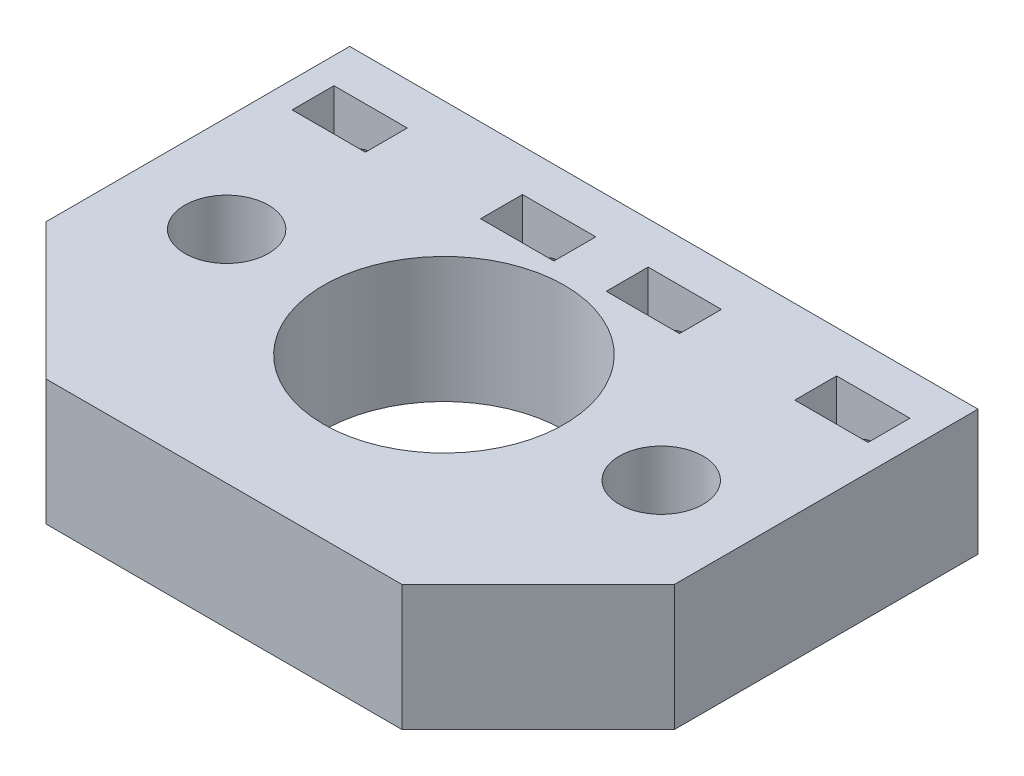
ISO-10303-21;
HEADER;
FILE_DESCRIPTION(('STEP AP214'),'2;1');
FILE_NAME('part.step','',(''),(''),'','','');
FILE_SCHEMA(('AUTOMOTIVE_DESIGN { 1 0 10303 214 1 1 1 1 }'));
ENDSEC;
DATA;
#1=APPLICATION_CONTEXT('core data for automotive mechanical design processes');
#2=APPLICATION_PROTOCOL_DEFINITION('international standard','automotive_design',2000,#1);
#3=PRODUCT_CONTEXT('',#1,'mechanical');
#4=PRODUCT('Part','Part','',(#3));
#5=PRODUCT_RELATED_PRODUCT_CATEGORY('part','',(#4));
#6=PRODUCT_DEFINITION_FORMATION('','',#4);
#7=PRODUCT_DEFINITION_CONTEXT('part definition',#1,'design');
#8=PRODUCT_DEFINITION('design','',#6,#7);
#9=PRODUCT_DEFINITION_SHAPE('','',#8);
#10=(LENGTH_UNIT() NAMED_UNIT(*) SI_UNIT(.MILLI.,.METRE.));
#11=(NAMED_UNIT(*) PLANE_ANGLE_UNIT() SI_UNIT($,.RADIAN.));
#12=(NAMED_UNIT(*) SI_UNIT($,.STERADIAN.) SOLID_ANGLE_UNIT());
#13=UNCERTAINTY_MEASURE_WITH_UNIT(LENGTH_MEASURE(1.E-05),#10,'distance_accuracy_value','');
#14=(GEOMETRIC_REPRESENTATION_CONTEXT(3) GLOBAL_UNCERTAINTY_ASSIGNED_CONTEXT((#13)) GLOBAL_UNIT_ASSIGNED_CONTEXT((#10,
#11,#12)) REPRESENTATION_CONTEXT('',''));
#15=CARTESIAN_POINT('',(0.,0.,0.));
#16=DIRECTION('',(0.,0.,1.));
#17=DIRECTION('',(1.,0.,0.));
#18=AXIS2_PLACEMENT_3D('',#15,#16,#17);
#19=CARTESIAN_POINT('',(0.,12.,0.));
#20=DIRECTION('',(0.,-1.,0.));
#21=DIRECTION('',(0.,0.,-1.));
#22=AXIS2_PLACEMENT_3D('',#19,#20,#21);
#23=PLANE('',#22);
#24=DIRECTION('',(1.,0.,0.));
#25=VECTOR('',#24,1.);
#26=CARTESIAN_POINT('',(0.,12.,-12.9999999999999));
#27=LINE('',#26,#25);
#28=CARTESIAN_POINT('',(2.49999999999995,12.,-12.9999999999999));
#29=VERTEX_POINT('',#28);
#30=CARTESIAN_POINT('',(9.49999999999995,12.,-12.9999999999999));
#31=VERTEX_POINT('',#30);
#32=EDGE_CURVE('E304',#29,#31,#27,.T.);
#33=ORIENTED_EDGE('',*,*,#32,.F.);
#34=DIRECTION('',(0.,0.,1.));
#35=VECTOR('',#34,1.);
#36=CARTESIAN_POINT('',(2.49999999999996,12.,0.));
#37=LINE('',#36,#35);
#38=CARTESIAN_POINT('',(2.49999999999994,12.,-17.));
#39=VERTEX_POINT('',#38);
#40=EDGE_CURVE('E298',#39,#29,#37,.T.);
#41=ORIENTED_EDGE('',*,*,#40,.F.);
#42=DIRECTION('',(-1.,0.,0.));
#43=VECTOR('',#42,1.);
#44=CARTESIAN_POINT('',(2.94902990916058E-13,12.,-17.));
#45=LINE('',#44,#43);
#46=CARTESIAN_POINT('',(9.49999999999994,12.,-16.9999999999999));
#47=VERTEX_POINT('',#46);
#48=EDGE_CURVE('E300',#47,#39,#45,.T.);
#49=ORIENTED_EDGE('',*,*,#48,.F.);
#50=DIRECTION('',(0.,0.,-1.));
#51=VECTOR('',#50,1.);
#52=CARTESIAN_POINT('',(9.49999999999997,12.,0.));
#53=LINE('',#52,#51);
#54=EDGE_CURVE('E302',#31,#47,#53,.T.);
#55=ORIENTED_EDGE('',*,*,#54,.F.);
#56=EDGE_LOOP('',(#33,#41,#49,#55));
#57=FACE_BOUND('',#56,.T.);
#58=DIRECTION('',(0.,0.,1.));
#59=VECTOR('',#58,1.);
#60=CARTESIAN_POINT('',(-27.5,12.,0.));
#61=LINE('',#60,#59);
#62=CARTESIAN_POINT('',(-27.4999999999999,12.,-17.));
#63=VERTEX_POINT('',#62);
#64=CARTESIAN_POINT('',(-27.4999999999999,12.,-13.));
#65=VERTEX_POINT('',#64);
#66=EDGE_CURVE('E287',#63,#65,#61,.T.);
#67=ORIENTED_EDGE('',*,*,#66,.F.);
#68=DIRECTION('',(-1.,0.,0.));
#69=VECTOR('',#68,1.);
#70=CARTESIAN_POINT('',(-3.03328790656524E-13,12.,-17.0000000000005));
#71=LINE('',#70,#69);
#72=CARTESIAN_POINT('',(-20.4999999999999,12.,-17.0000000000001));
#73=VERTEX_POINT('',#72);
#74=EDGE_CURVE('E196',#73,#63,#71,.T.);
#75=ORIENTED_EDGE('',*,*,#74,.F.);
#76=DIRECTION('',(0.,0.,-1.));
#77=VECTOR('',#76,1.);
#78=CARTESIAN_POINT('',(-20.5,12.,0.));
#79=LINE('',#78,#77);
#80=CARTESIAN_POINT('',(-20.4999999999999,12.,-13.));
#81=VERTEX_POINT('',#80);
#82=EDGE_CURVE('E282',#81,#73,#79,.T.);
#83=ORIENTED_EDGE('',*,*,#82,.F.);
#84=DIRECTION('',(1.,0.,0.));
#85=VECTOR('',#84,1.);
#86=CARTESIAN_POINT('',(0.,12.,-13.));
#87=LINE('',#86,#85);
#88=EDGE_CURVE('E285',#65,#81,#87,.T.);
#89=ORIENTED_EDGE('',*,*,#88,.F.);
#90=EDGE_LOOP('',(#67,#75,#83,#89));
#91=FACE_BOUND('',#90,.T.);
#92=CARTESIAN_POINT('',(-20.75,12.,0.));
#93=DIRECTION('',(0.,-1.,0.));
#94=DIRECTION('',(0.,0.,-1.));
#95=AXIS2_PLACEMENT_3D('',#92,#93,#94);
#96=CIRCLE('',#95,4.);
#97=CARTESIAN_POINT('',(-20.75,12.,-4.00000000000001));
#98=VERTEX_POINT('',#97);
#99=EDGE_CURVE('E328',#98,#98,#96,.F.);
#100=ORIENTED_EDGE('',*,*,#99,.F.);
#101=EDGE_LOOP('',(#100));
#102=FACE_BOUND('',#101,.T.);
#103=CARTESIAN_POINT('',(20.75,12.,0.));
#104=DIRECTION('',(0.,-1.,0.));
#105=DIRECTION('',(0.,0.,-1.));
#106=AXIS2_PLACEMENT_3D('',#103,#104,#105);
#107=CIRCLE('',#106,4.);
#108=CARTESIAN_POINT('',(20.75,12.,-4.));
#109=VERTEX_POINT('',#108);
#110=EDGE_CURVE('E325',#109,#109,#107,.F.);
#111=ORIENTED_EDGE('',*,*,#110,.F.);
#112=EDGE_LOOP('',(#111));
#113=FACE_BOUND('',#112,.T.);
#114=CARTESIAN_POINT('',(0.,12.,0.));
#115=DIRECTION('',(0.,-1.,0.));
#116=DIRECTION('',(0.,0.,-1.));
#117=AXIS2_PLACEMENT_3D('',#114,#115,#116);
#118=CIRCLE('',#117,11.5);
#119=CARTESIAN_POINT('',(0.,12.,-11.5));
#120=VERTEX_POINT('',#119);
#121=EDGE_CURVE('E322',#120,#120,#118,.F.);
#122=ORIENTED_EDGE('',*,*,#121,.F.);
#123=EDGE_LOOP('',(#122));
#124=FACE_BOUND('',#123,.T.);
#125=DIRECTION('',(1.,0.,0.));
#126=VECTOR('',#125,1.);
#127=CARTESIAN_POINT('',(-30.,12.,21.));
#128=LINE('',#127,#126);
#129=CARTESIAN_POINT('',(-17.,12.,21.));
#130=VERTEX_POINT('',#129);
#131=CARTESIAN_POINT('',(17.,12.,21.));
#132=VERTEX_POINT('',#131);
#133=EDGE_CURVE('E340',#130,#132,#128,.T.);
#134=ORIENTED_EDGE('',*,*,#133,.T.);
#135=DIRECTION('',(-0.707106781186549,0.,0.707106781186546));
#136=VECTOR('',#135,1.);
#137=CARTESIAN_POINT('',(30.,12.,8.00000000000002));
#138=LINE('',#137,#136);
#139=CARTESIAN_POINT('',(30.,12.,8.00000000000002));
#140=VERTEX_POINT('',#139);
#141=EDGE_CURVE('E45',#132,#140,#138,.F.);
#142=ORIENTED_EDGE('',*,*,#141,.T.);
#143=DIRECTION('',(0.,0.,-1.));
#144=VECTOR('',#143,1.);
#145=CARTESIAN_POINT('',(30.,12.,21.));
#146=LINE('',#145,#144);
#147=CARTESIAN_POINT('',(30.,12.,-21.));
#148=VERTEX_POINT('',#147);
#149=EDGE_CURVE('E332',#140,#148,#146,.T.);
#150=ORIENTED_EDGE('',*,*,#149,.T.);
#151=DIRECTION('',(-1.,0.,0.));
#152=VECTOR('',#151,1.);
#153=CARTESIAN_POINT('',(-30.,12.,-21.));
#154=LINE('',#153,#152);
#155=CARTESIAN_POINT('',(-30.,12.,-21.));
#156=VERTEX_POINT('',#155);
#157=EDGE_CURVE('E334',#148,#156,#154,.T.);
#158=ORIENTED_EDGE('',*,*,#157,.T.);
#159=DIRECTION('',(0.,0.,1.));
#160=VECTOR('',#159,1.);
#161=CARTESIAN_POINT('',(-30.,12.,21.));
#162=LINE('',#161,#160);
#163=CARTESIAN_POINT('',(-30.,12.,7.99999999999996));
#164=VERTEX_POINT('',#163);
#165=EDGE_CURVE('E337',#156,#164,#162,.T.);
#166=ORIENTED_EDGE('',*,*,#165,.T.);
#167=DIRECTION('',(-0.707106781186546,0.,-0.707106781186549));
#168=VECTOR('',#167,1.);
#169=CARTESIAN_POINT('',(-17.,12.,21.));
#170=LINE('',#169,#168);
#171=EDGE_CURVE('E369',#164,#130,#170,.F.);
#172=ORIENTED_EDGE('',*,*,#171,.T.);
#173=EDGE_LOOP('',(#134,#142,#150,#158,#166,#172));
#174=FACE_BOUND('',#173,.T.);
#175=DIRECTION('',(0.,0.,1.));
#176=VECTOR('',#175,1.);
#177=CARTESIAN_POINT('',(-9.49999999999995,12.,0.));
#178=LINE('',#177,#176);
#179=CARTESIAN_POINT('',(-9.49999999999994,12.,-16.9999999999999));
#180=VERTEX_POINT('',#179);
#181=CARTESIAN_POINT('',(-9.49999999999994,12.,-12.9999999999999));
#182=VERTEX_POINT('',#181);
#183=EDGE_CURVE('E296',#180,#182,#178,.T.);
#184=ORIENTED_EDGE('',*,*,#183,.F.);
#185=DIRECTION('',(-1.,0.,0.));
#186=VECTOR('',#185,1.);
#187=CARTESIAN_POINT('',(-3.03328790656517E-13,12.,-17.));
#188=LINE('',#187,#186);
#189=CARTESIAN_POINT('',(-2.49999999999994,12.,-17.));
#190=VERTEX_POINT('',#189);
#191=EDGE_CURVE('E289',#190,#180,#188,.T.);
#192=ORIENTED_EDGE('',*,*,#191,.F.);
#193=DIRECTION('',(0.,0.,-1.));
#194=VECTOR('',#193,1.);
#195=CARTESIAN_POINT('',(-2.49999999999995,12.,0.));
#196=LINE('',#195,#194);
#197=CARTESIAN_POINT('',(-2.49999999999994,12.,-12.9999999999999));
#198=VERTEX_POINT('',#197);
#199=EDGE_CURVE('E291',#198,#190,#196,.T.);
#200=ORIENTED_EDGE('',*,*,#199,.F.);
#201=DIRECTION('',(1.,0.,0.));
#202=VECTOR('',#201,1.);
#203=CARTESIAN_POINT('',(0.,12.,-12.9999999999999));
#204=LINE('',#203,#202);
#205=EDGE_CURVE('E294',#182,#198,#204,.T.);
#206=ORIENTED_EDGE('',*,*,#205,.F.);
#207=EDGE_LOOP('',(#184,#192,#200,#206));
#208=FACE_BOUND('',#207,.T.);
#209=DIRECTION('',(0.,0.,1.));
#210=VECTOR('',#209,1.);
#211=CARTESIAN_POINT('',(20.5,12.,0.));
#212=LINE('',#211,#210);
#213=CARTESIAN_POINT('',(20.4999999999999,12.,-17.0000000000001));
#214=VERTEX_POINT('',#213);
#215=CARTESIAN_POINT('',(20.4999999999999,12.,-13.));
#216=VERTEX_POINT('',#215);
#217=EDGE_CURVE('E193',#214,#216,#212,.T.);
#218=ORIENTED_EDGE('',*,*,#217,.F.);
#219=DIRECTION('',(-1.,0.,0.));
#220=VECTOR('',#219,1.);
#221=CARTESIAN_POINT('',(2.94902990916065E-13,12.,-17.0000000000005));
#222=LINE('',#221,#220);
#223=CARTESIAN_POINT('',(27.4999999999999,12.,-17.));
#224=VERTEX_POINT('',#223);
#225=EDGE_CURVE('E306',#224,#214,#222,.T.);
#226=ORIENTED_EDGE('',*,*,#225,.F.);
#227=DIRECTION('',(0.,0.,-1.));
#228=VECTOR('',#227,1.);
#229=CARTESIAN_POINT('',(27.5,12.,0.));
#230=LINE('',#229,#228);
#231=CARTESIAN_POINT('',(27.4999999999999,12.,-13.));
#232=VERTEX_POINT('',#231);
#233=EDGE_CURVE('E308',#232,#224,#230,.T.);
#234=ORIENTED_EDGE('',*,*,#233,.F.);
#235=DIRECTION('',(1.,0.,0.));
#236=VECTOR('',#235,1.);
#237=CARTESIAN_POINT('',(0.,12.,-13.));
#238=LINE('',#237,#236);
#239=EDGE_CURVE('E310',#216,#232,#238,.T.);
#240=ORIENTED_EDGE('',*,*,#239,.F.);
#241=EDGE_LOOP('',(#218,#226,#234,#240));
#242=FACE_BOUND('',#241,.T.);
#243=ADVANCED_FACE('F35',(#57,#91,#102,#113,#124,#174,#208,#242),#23,.F.);
#244=CARTESIAN_POINT('',(0.,0.,0.));
#245=DIRECTION('',(0.,-1.,0.));
#246=DIRECTION('',(0.,0.,-1.));
#247=AXIS2_PLACEMENT_3D('',#244,#245,#246);
#248=PLANE('',#247);
#249=CARTESIAN_POINT('',(-20.75,0.,0.));
#250=DIRECTION('',(0.,-1.,0.));
#251=DIRECTION('',(0.,0.,-1.));
#252=AXIS2_PLACEMENT_3D('',#249,#250,#251);
#253=CIRCLE('',#252,4.);
#254=CARTESIAN_POINT('',(-20.75,0.,-4.00000000000001));
#255=VERTEX_POINT('',#254);
#256=EDGE_CURVE('E313',#255,#255,#253,.F.);
#257=ORIENTED_EDGE('',*,*,#256,.T.);
#258=EDGE_LOOP('',(#257));
#259=FACE_BOUND('',#258,.T.);
#260=CARTESIAN_POINT('',(20.75,0.,0.));
#261=DIRECTION('',(0.,-1.,0.));
#262=DIRECTION('',(0.,0.,-1.));
#263=AXIS2_PLACEMENT_3D('',#260,#261,#262);
#264=CIRCLE('',#263,4.);
#265=CARTESIAN_POINT('',(20.75,0.,-4.));
#266=VERTEX_POINT('',#265);
#267=EDGE_CURVE('E314',#266,#266,#264,.F.);
#268=ORIENTED_EDGE('',*,*,#267,.T.);
#269=EDGE_LOOP('',(#268));
#270=FACE_BOUND('',#269,.T.);
#271=CARTESIAN_POINT('',(0.,0.,0.));
#272=DIRECTION('',(0.,-1.,0.));
#273=DIRECTION('',(0.,0.,-1.));
#274=AXIS2_PLACEMENT_3D('',#271,#272,#273);
#275=CIRCLE('',#274,11.5);
#276=CARTESIAN_POINT('',(0.,0.,-11.5));
#277=VERTEX_POINT('',#276);
#278=EDGE_CURVE('E317',#277,#277,#275,.F.);
#279=ORIENTED_EDGE('',*,*,#278,.T.);
#280=EDGE_LOOP('',(#279));
#281=FACE_BOUND('',#280,.T.);
#282=DIRECTION('',(0.,0.,-1.));
#283=VECTOR('',#282,1.);
#284=CARTESIAN_POINT('',(30.,0.,21.));
#285=LINE('',#284,#283);
#286=CARTESIAN_POINT('',(30.,0.,8.00000000000002));
#287=VERTEX_POINT('',#286);
#288=CARTESIAN_POINT('',(30.,0.,-21.));
#289=VERTEX_POINT('',#288);
#290=EDGE_CURVE('E331',#287,#289,#285,.T.);
#291=ORIENTED_EDGE('',*,*,#290,.F.);
#292=DIRECTION('',(0.707106781186549,0.,-0.707106781186546));
#293=VECTOR('',#292,1.);
#294=CARTESIAN_POINT('',(18.9999999999999,0.,19.));
#295=LINE('',#294,#293);
#296=CARTESIAN_POINT('',(17.,0.,21.));
#297=VERTEX_POINT('',#296);
#298=EDGE_CURVE('E362',#287,#297,#295,.F.);
#299=ORIENTED_EDGE('',*,*,#298,.T.);
#300=DIRECTION('',(1.,0.,0.));
#301=VECTOR('',#300,1.);
#302=CARTESIAN_POINT('',(-30.,0.,21.));
#303=LINE('',#302,#301);
#304=CARTESIAN_POINT('',(-17.,0.,21.));
#305=VERTEX_POINT('',#304);
#306=EDGE_CURVE('E335',#305,#297,#303,.T.);
#307=ORIENTED_EDGE('',*,*,#306,.F.);
#308=DIRECTION('',(0.707106781186546,0.,0.707106781186549));
#309=VECTOR('',#308,1.);
#310=CARTESIAN_POINT('',(-19.,0.,19.));
#311=LINE('',#310,#309);
#312=CARTESIAN_POINT('',(-30.,0.,7.99999999999996));
#313=VERTEX_POINT('',#312);
#314=EDGE_CURVE('E360',#305,#313,#311,.F.);
#315=ORIENTED_EDGE('',*,*,#314,.T.);
#316=DIRECTION('',(0.,0.,1.));
#317=VECTOR('',#316,1.);
#318=CARTESIAN_POINT('',(-30.,0.,21.));
#319=LINE('',#318,#317);
#320=CARTESIAN_POINT('',(-30.,0.,-21.));
#321=VERTEX_POINT('',#320);
#322=EDGE_CURVE('E347',#321,#313,#319,.T.);
#323=ORIENTED_EDGE('',*,*,#322,.F.);
#324=DIRECTION('',(-1.,0.,0.));
#325=VECTOR('',#324,1.);
#326=CARTESIAN_POINT('',(-30.,0.,-21.));
#327=LINE('',#326,#325);
#328=EDGE_CURVE('E345',#289,#321,#327,.T.);
#329=ORIENTED_EDGE('',*,*,#328,.F.);
#330=EDGE_LOOP('',(#291,#299,#307,#315,#323,#329));
#331=FACE_BOUND('',#330,.T.);
#332=DIRECTION('',(-1.,0.,0.));
#333=VECTOR('',#332,1.);
#334=CARTESIAN_POINT('',(-27.4999999999999,0.,-17.));
#335=LINE('',#334,#333);
#336=CARTESIAN_POINT('',(-20.4999999999999,0.,-17.0000000000001));
#337=VERTEX_POINT('',#336);
#338=CARTESIAN_POINT('',(-27.4999999999999,0.,-17.));
#339=VERTEX_POINT('',#338);
#340=EDGE_CURVE('E264',#337,#339,#335,.T.);
#341=ORIENTED_EDGE('',*,*,#340,.T.);
#342=DIRECTION('',(0.,0.,1.));
#343=VECTOR('',#342,1.);
#344=CARTESIAN_POINT('',(-27.4999999999999,0.,-17.));
#345=LINE('',#344,#343);
#346=CARTESIAN_POINT('',(-27.4999999999999,0.,-13.));
#347=VERTEX_POINT('',#346);
#348=EDGE_CURVE('E267',#339,#347,#345,.T.);
#349=ORIENTED_EDGE('',*,*,#348,.T.);
#350=DIRECTION('',(1.,0.,0.));
#351=VECTOR('',#350,1.);
#352=CARTESIAN_POINT('',(-27.4999999999999,0.,-13.));
#353=LINE('',#352,#351);
#354=CARTESIAN_POINT('',(-20.4999999999999,0.,-13.));
#355=VERTEX_POINT('',#354);
#356=EDGE_CURVE('E270',#347,#355,#353,.T.);
#357=ORIENTED_EDGE('',*,*,#356,.T.);
#358=DIRECTION('',(0.,0.,-1.));
#359=VECTOR('',#358,1.);
#360=CARTESIAN_POINT('',(-20.4999999999999,0.,-17.0000000000001));
#361=LINE('',#360,#359);
#362=EDGE_CURVE('E261',#355,#337,#361,.T.);
#363=ORIENTED_EDGE('',*,*,#362,.T.);
#364=EDGE_LOOP('',(#341,#349,#357,#363));
#365=FACE_BOUND('',#364,.T.);
#366=DIRECTION('',(-1.,0.,0.));
#367=VECTOR('',#366,1.);
#368=CARTESIAN_POINT('',(-9.49999999999994,0.,-16.9999999999999));
#369=LINE('',#368,#367);
#370=CARTESIAN_POINT('',(-2.49999999999994,0.,-17.));
#371=VERTEX_POINT('',#370);
#372=CARTESIAN_POINT('',(-9.49999999999994,0.,-16.9999999999999));
#373=VERTEX_POINT('',#372);
#374=EDGE_CURVE('E243',#371,#373,#369,.T.);
#375=ORIENTED_EDGE('',*,*,#374,.T.);
#376=DIRECTION('',(0.,0.,1.));
#377=VECTOR('',#376,1.);
#378=CARTESIAN_POINT('',(-9.49999999999994,0.,-16.9999999999999));
#379=LINE('',#378,#377);
#380=CARTESIAN_POINT('',(-9.49999999999994,0.,-12.9999999999999));
#381=VERTEX_POINT('',#380);
#382=EDGE_CURVE('E247',#373,#381,#379,.T.);
#383=ORIENTED_EDGE('',*,*,#382,.T.);
#384=DIRECTION('',(1.,0.,0.));
#385=VECTOR('',#384,1.);
#386=CARTESIAN_POINT('',(-9.49999999999994,0.,-12.9999999999999));
#387=LINE('',#386,#385);
#388=CARTESIAN_POINT('',(-2.49999999999994,0.,-12.9999999999999));
#389=VERTEX_POINT('',#388);
#390=EDGE_CURVE('E250',#381,#389,#387,.T.);
#391=ORIENTED_EDGE('',*,*,#390,.T.);
#392=DIRECTION('',(0.,0.,-1.));
#393=VECTOR('',#392,1.);
#394=CARTESIAN_POINT('',(-2.49999999999994,0.,-17.));
#395=LINE('',#394,#393);
#396=EDGE_CURVE('E240',#389,#371,#395,.T.);
#397=ORIENTED_EDGE('',*,*,#396,.T.);
#398=EDGE_LOOP('',(#375,#383,#391,#397));
#399=FACE_BOUND('',#398,.T.);
#400=DIRECTION('',(0.,0.,1.));
#401=VECTOR('',#400,1.);
#402=CARTESIAN_POINT('',(2.49999999999994,0.,-17.));
#403=LINE('',#402,#401);
#404=CARTESIAN_POINT('',(2.49999999999994,0.,-17.));
#405=VERTEX_POINT('',#404);
#406=CARTESIAN_POINT('',(2.49999999999995,0.,-12.9999999999999));
#407=VERTEX_POINT('',#406);
#408=EDGE_CURVE('E222',#405,#407,#403,.T.);
#409=ORIENTED_EDGE('',*,*,#408,.T.);
#410=DIRECTION('',(1.,0.,0.));
#411=VECTOR('',#410,1.);
#412=CARTESIAN_POINT('',(9.49999999999995,0.,-12.9999999999999));
#413=LINE('',#412,#411);
#414=CARTESIAN_POINT('',(9.49999999999995,0.,-12.9999999999999));
#415=VERTEX_POINT('',#414);
#416=EDGE_CURVE('E226',#407,#415,#413,.T.);
#417=ORIENTED_EDGE('',*,*,#416,.T.);
#418=DIRECTION('',(0.,0.,-1.));
#419=VECTOR('',#418,1.);
#420=CARTESIAN_POINT('',(9.49999999999994,0.,-16.9999999999999));
#421=LINE('',#420,#419);
#422=CARTESIAN_POINT('',(9.49999999999994,0.,-16.9999999999999));
#423=VERTEX_POINT('',#422);
#424=EDGE_CURVE('E229',#415,#423,#421,.T.);
#425=ORIENTED_EDGE('',*,*,#424,.T.);
#426=DIRECTION('',(-1.,0.,0.));
#427=VECTOR('',#426,1.);
#428=CARTESIAN_POINT('',(9.49999999999994,0.,-16.9999999999999));
#429=LINE('',#428,#427);
#430=EDGE_CURVE('E219',#423,#405,#429,.T.);
#431=ORIENTED_EDGE('',*,*,#430,.T.);
#432=EDGE_LOOP('',(#409,#417,#425,#431));
#433=FACE_BOUND('',#432,.T.);
#434=DIRECTION('',(-1.,0.,0.));
#435=VECTOR('',#434,1.);
#436=CARTESIAN_POINT('',(27.4999999999999,0.,-17.));
#437=LINE('',#436,#435);
#438=CARTESIAN_POINT('',(27.4999999999999,0.,-17.));
#439=VERTEX_POINT('',#438);
#440=CARTESIAN_POINT('',(20.4999999999999,0.,-17.0000000000001));
#441=VERTEX_POINT('',#440);
#442=EDGE_CURVE('E210',#439,#441,#437,.T.);
#443=ORIENTED_EDGE('',*,*,#442,.T.);
#444=DIRECTION('',(0.,0.,1.));
#445=VECTOR('',#444,1.);
#446=CARTESIAN_POINT('',(20.4999999999999,0.,-17.0000000000001));
#447=LINE('',#446,#445);
#448=CARTESIAN_POINT('',(20.4999999999999,0.,-13.));
#449=VERTEX_POINT('',#448);
#450=EDGE_CURVE('E190',#441,#449,#447,.T.);
#451=ORIENTED_EDGE('',*,*,#450,.T.);
#452=DIRECTION('',(1.,0.,0.));
#453=VECTOR('',#452,1.);
#454=CARTESIAN_POINT('',(27.4999999999999,0.,-13.));
#455=LINE('',#454,#453);
#456=CARTESIAN_POINT('',(27.4999999999999,0.,-13.));
#457=VERTEX_POINT('',#456);
#458=EDGE_CURVE('E200',#449,#457,#455,.T.);
#459=ORIENTED_EDGE('',*,*,#458,.T.);
#460=DIRECTION('',(0.,0.,-1.));
#461=VECTOR('',#460,1.);
#462=CARTESIAN_POINT('',(27.4999999999999,0.,-17.));
#463=LINE('',#462,#461);
#464=EDGE_CURVE('E212',#457,#439,#463,.T.);
#465=ORIENTED_EDGE('',*,*,#464,.T.);
#466=EDGE_LOOP('',(#443,#451,#459,#465));
#467=FACE_BOUND('',#466,.T.);
#468=ADVANCED_FACE('F209',(#259,#270,#281,#331,#365,#399,#433,#467),#248,.T.);
#469=CARTESIAN_POINT('',(30.,12.,21.));
#470=DIRECTION('',(-1.,0.,0.));
#471=DIRECTION('',(0.,0.,1.));
#472=AXIS2_PLACEMENT_3D('',#469,#470,#471);
#473=PLANE('',#472);
#474=ORIENTED_EDGE('',*,*,#149,.F.);
#475=DIRECTION('',(0.,-1.,0.));
#476=VECTOR('',#475,1.);
#477=CARTESIAN_POINT('',(30.,12.,8.00000000000002));
#478=LINE('',#477,#476);
#479=EDGE_CURVE('E357',#140,#287,#478,.T.);
#480=ORIENTED_EDGE('',*,*,#479,.T.);
#481=ORIENTED_EDGE('',*,*,#290,.T.);
#482=DIRECTION('',(0.,-1.,0.));
#483=VECTOR('',#482,1.);
#484=CARTESIAN_POINT('',(30.,12.,-21.));
#485=LINE('',#484,#483);
#486=EDGE_CURVE('E354',#148,#289,#485,.T.);
#487=ORIENTED_EDGE('',*,*,#486,.F.);
#488=EDGE_LOOP('',(#474,#480,#481,#487));
#489=FACE_BOUND('',#488,.T.);
#490=ADVANCED_FACE('F414',(#489),#473,.F.);
#491=CARTESIAN_POINT('',(-30.,12.,-21.));
#492=DIRECTION('',(0.,0.,1.));
#493=DIRECTION('',(1.,0.,0.));
#494=AXIS2_PLACEMENT_3D('',#491,#492,#493);
#495=PLANE('',#494);
#496=CARTESIAN_POINT('',(24.,6.,-21.));
#497=DIRECTION('',(0.,0.,-1.));
#498=DIRECTION('',(-1.,0.,0.));
#499=AXIS2_PLACEMENT_3D('',#496,#497,#498);
#500=CIRCLE('',#499,2.25);
#501=CARTESIAN_POINT('',(21.75,6.,-21.));
#502=VERTEX_POINT('',#501);
#503=EDGE_CURVE('E376',#502,#502,#500,.T.);
#504=ORIENTED_EDGE('',*,*,#503,.F.);
#505=EDGE_LOOP('',(#504));
#506=FACE_BOUND('',#505,.T.);
#507=CARTESIAN_POINT('',(-6.,6.,-21.));
#508=DIRECTION('',(0.,0.,-1.));
#509=DIRECTION('',(1.,0.,0.));
#510=AXIS2_PLACEMENT_3D('',#507,#508,#509);
#511=CIRCLE('',#510,2.25);
#512=CARTESIAN_POINT('',(-3.75,6.,-21.));
#513=VERTEX_POINT('',#512);
#514=EDGE_CURVE('E517',#513,#513,#511,.T.);
#515=ORIENTED_EDGE('',*,*,#514,.F.);
#516=EDGE_LOOP('',(#515));
#517=FACE_BOUND('',#516,.T.);
#518=CARTESIAN_POINT('',(6.,6.,-21.));
#519=DIRECTION('',(0.,0.,-1.));
#520=DIRECTION('',(-1.,0.,0.));
#521=AXIS2_PLACEMENT_3D('',#518,#519,#520);
#522=CIRCLE('',#521,2.25);
#523=CARTESIAN_POINT('',(3.75,6.,-21.));
#524=VERTEX_POINT('',#523);
#525=EDGE_CURVE('E514',#524,#524,#522,.T.);
#526=ORIENTED_EDGE('',*,*,#525,.F.);
#527=EDGE_LOOP('',(#526));
#528=FACE_BOUND('',#527,.T.);
#529=CARTESIAN_POINT('',(-24.,6.00000000000001,-21.));
#530=DIRECTION('',(0.,0.,-1.));
#531=DIRECTION('',(1.,0.,0.));
#532=AXIS2_PLACEMENT_3D('',#529,#530,#531);
#533=CIRCLE('',#532,2.25);
#534=CARTESIAN_POINT('',(-21.75,6.00000000000001,-21.));
#535=VERTEX_POINT('',#534);
#536=EDGE_CURVE('E511',#535,#535,#533,.T.);
#537=ORIENTED_EDGE('',*,*,#536,.F.);
#538=EDGE_LOOP('',(#537));
#539=FACE_BOUND('',#538,.T.);
#540=ORIENTED_EDGE('',*,*,#328,.T.);
#541=DIRECTION('',(0.,-1.,0.));
#542=VECTOR('',#541,1.);
#543=CARTESIAN_POINT('',(-30.,12.,-21.));
#544=LINE('',#543,#542);
#545=EDGE_CURVE('E343',#156,#321,#544,.T.);
#546=ORIENTED_EDGE('',*,*,#545,.F.);
#547=ORIENTED_EDGE('',*,*,#157,.F.);
#548=ORIENTED_EDGE('',*,*,#486,.T.);
#549=EDGE_LOOP('',(#540,#546,#547,#548));
#550=FACE_BOUND('',#549,.T.);
#551=ADVANCED_FACE('F461',(#506,#517,#528,#539,#550),#495,.F.);
#552=CARTESIAN_POINT('',(-30.,12.,21.));
#553=DIRECTION('',(1.,0.,0.));
#554=DIRECTION('',(0.,0.,-1.));
#555=AXIS2_PLACEMENT_3D('',#552,#553,#554);
#556=PLANE('',#555);
#557=ORIENTED_EDGE('',*,*,#322,.T.);
#558=DIRECTION('',(0.,1.,0.));
#559=VECTOR('',#558,1.);
#560=CARTESIAN_POINT('',(-30.,12.,7.99999999999995));
#561=LINE('',#560,#559);
#562=EDGE_CURVE('E11',#313,#164,#561,.T.);
#563=ORIENTED_EDGE('',*,*,#562,.T.);
#564=ORIENTED_EDGE('',*,*,#165,.F.);
#565=ORIENTED_EDGE('',*,*,#545,.T.);
#566=EDGE_LOOP('',(#557,#563,#564,#565));
#567=FACE_BOUND('',#566,.T.);
#568=ADVANCED_FACE('F457',(#567),#556,.F.);
#569=CARTESIAN_POINT('',(-30.,12.,21.));
#570=DIRECTION('',(0.,0.,-1.));
#571=DIRECTION('',(-1.,0.,0.));
#572=AXIS2_PLACEMENT_3D('',#569,#570,#571);
#573=PLANE('',#572);
#574=ORIENTED_EDGE('',*,*,#306,.T.);
#575=DIRECTION('',(0.,1.,0.));
#576=VECTOR('',#575,1.);
#577=CARTESIAN_POINT('',(17.,12.,21.));
#578=LINE('',#577,#576);
#579=EDGE_CURVE('E367',#297,#132,#578,.T.);
#580=ORIENTED_EDGE('',*,*,#579,.T.);
#581=ORIENTED_EDGE('',*,*,#133,.F.);
#582=DIRECTION('',(0.,-1.,0.));
#583=VECTOR('',#582,1.);
#584=CARTESIAN_POINT('',(-17.,12.,21.));
#585=LINE('',#584,#583);
#586=EDGE_CURVE('E364',#130,#305,#585,.T.);
#587=ORIENTED_EDGE('',*,*,#586,.T.);
#588=EDGE_LOOP('',(#574,#580,#581,#587));
#589=FACE_BOUND('',#588,.T.);
#590=ADVANCED_FACE('F454',(#589),#573,.F.);
#591=CARTESIAN_POINT('',(0.,12.000012,0.));
#592=DIRECTION('',(0.,-1.,0.));
#593=DIRECTION('',(0.,0.,-1.));
#594=AXIS2_PLACEMENT_3D('',#591,#592,#593);
#595=CYLINDRICAL_SURFACE('',#594,11.5);
#596=ORIENTED_EDGE('',*,*,#278,.F.);
#597=EDGE_LOOP('',(#596));
#598=FACE_BOUND('',#597,.T.);
#599=ORIENTED_EDGE('',*,*,#121,.T.);
#600=EDGE_LOOP('',(#599));
#601=FACE_BOUND('',#600,.T.);
#602=ADVANCED_FACE('F451',(#598,#601),#595,.F.);
#603=CARTESIAN_POINT('',(20.75,12.000012,0.));
#604=DIRECTION('',(0.,-1.,0.));
#605=DIRECTION('',(0.,0.,-1.));
#606=AXIS2_PLACEMENT_3D('',#603,#604,#605);
#607=CYLINDRICAL_SURFACE('',#606,4.);
#608=ORIENTED_EDGE('',*,*,#267,.F.);
#609=EDGE_LOOP('',(#608));
#610=FACE_BOUND('',#609,.T.);
#611=ORIENTED_EDGE('',*,*,#110,.T.);
#612=EDGE_LOOP('',(#611));
#613=FACE_BOUND('',#612,.T.);
#614=ADVANCED_FACE('F480',(#610,#613),#607,.F.);
#615=CARTESIAN_POINT('',(-20.75,12.000012,0.));
#616=DIRECTION('',(0.,-1.,0.));
#617=DIRECTION('',(0.,0.,-1.));
#618=AXIS2_PLACEMENT_3D('',#615,#616,#617);
#619=CYLINDRICAL_SURFACE('',#618,4.);
#620=ORIENTED_EDGE('',*,*,#256,.F.);
#621=EDGE_LOOP('',(#620));
#622=FACE_BOUND('',#621,.T.);
#623=ORIENTED_EDGE('',*,*,#99,.T.);
#624=EDGE_LOOP('',(#623));
#625=FACE_BOUND('',#624,.T.);
#626=ADVANCED_FACE('F473',(#622,#625),#619,.F.);
#627=CARTESIAN_POINT('',(30.,12.,8.00000000000002));
#628=DIRECTION('',(-0.707106781186546,0.,-0.707106781186549));
#629=DIRECTION('',(0.,-1.,0.));
#630=AXIS2_PLACEMENT_3D('',#627,#628,#629);
#631=PLANE('',#630);
#632=ORIENTED_EDGE('',*,*,#141,.F.);
#633=ORIENTED_EDGE('',*,*,#579,.F.);
#634=ORIENTED_EDGE('',*,*,#298,.F.);
#635=ORIENTED_EDGE('',*,*,#479,.F.);
#636=EDGE_LOOP('',(#632,#633,#634,#635));
#637=FACE_BOUND('',#636,.T.);
#638=ADVANCED_FACE('F469',(#637),#631,.F.);
#639=CARTESIAN_POINT('',(-17.,12.,21.));
#640=DIRECTION('',(0.707106781186549,0.,-0.707106781186546));
#641=DIRECTION('',(0.,-1.,0.));
#642=AXIS2_PLACEMENT_3D('',#639,#640,#641);
#643=PLANE('',#642);
#644=ORIENTED_EDGE('',*,*,#171,.F.);
#645=ORIENTED_EDGE('',*,*,#562,.F.);
#646=ORIENTED_EDGE('',*,*,#314,.F.);
#647=ORIENTED_EDGE('',*,*,#586,.F.);
#648=EDGE_LOOP('',(#644,#645,#646,#647));
#649=FACE_BOUND('',#648,.T.);
#650=ADVANCED_FACE('F38',(#649),#643,.F.);
#651=CARTESIAN_POINT('',(-27.4999999999999,12.000012,-17.));
#652=DIRECTION('',(1.,0.,0.));
#653=DIRECTION('',(0.,0.,-1.));
#654=AXIS2_PLACEMENT_3D('',#651,#652,#653);
#655=PLANE('',#654);
#656=ORIENTED_EDGE('',*,*,#66,.T.);
#657=DIRECTION('',(0.,-1.,0.));
#658=VECTOR('',#657,1.);
#659=CARTESIAN_POINT('',(-27.4999999999999,12.000012,-13.));
#660=LINE('',#659,#658);
#661=EDGE_CURVE('E244',#65,#347,#660,.T.);
#662=ORIENTED_EDGE('',*,*,#661,.T.);
#663=ORIENTED_EDGE('',*,*,#348,.F.);
#664=DIRECTION('',(0.,-1.,0.));
#665=VECTOR('',#664,1.);
#666=CARTESIAN_POINT('',(-27.4999999999999,12.000012,-17.));
#667=LINE('',#666,#665);
#668=EDGE_CURVE('E273',#63,#339,#667,.T.);
#669=ORIENTED_EDGE('',*,*,#668,.F.);
#670=EDGE_LOOP('',(#656,#662,#663,#669));
#671=FACE_BOUND('',#670,.T.);
#672=ADVANCED_FACE('F401',(#671),#655,.T.);
#673=CARTESIAN_POINT('',(-27.4999999999999,12.000012,-13.));
#674=DIRECTION('',(0.,0.,-1.));
#675=DIRECTION('',(-1.,0.,0.));
#676=AXIS2_PLACEMENT_3D('',#673,#674,#675);
#677=PLANE('',#676);
#678=ORIENTED_EDGE('',*,*,#88,.T.);
#679=DIRECTION('',(0.,-1.,0.));
#680=VECTOR('',#679,1.);
#681=CARTESIAN_POINT('',(-20.4999999999999,12.000012,-13.));
#682=LINE('',#681,#680);
#683=EDGE_CURVE('E278',#81,#355,#682,.T.);
#684=ORIENTED_EDGE('',*,*,#683,.T.);
#685=ORIENTED_EDGE('',*,*,#356,.F.);
#686=ORIENTED_EDGE('',*,*,#661,.F.);
#687=EDGE_LOOP('',(#678,#684,#685,#686));
#688=FACE_BOUND('',#687,.T.);
#689=ADVANCED_FACE('F407',(#688),#677,.T.);
#690=CARTESIAN_POINT('',(-20.4999999999999,12.000012,-17.0000000000001));
#691=DIRECTION('',(-1.,0.,0.));
#692=DIRECTION('',(0.,0.,1.));
#693=AXIS2_PLACEMENT_3D('',#690,#691,#692);
#694=PLANE('',#693);
#695=ORIENTED_EDGE('',*,*,#82,.T.);
#696=DIRECTION('',(0.,-1.,0.));
#697=VECTOR('',#696,1.);
#698=CARTESIAN_POINT('',(-20.4999999999999,12.000012,-17.0000000000001));
#699=LINE('',#698,#697);
#700=EDGE_CURVE('E276',#73,#337,#699,.T.);
#701=ORIENTED_EDGE('',*,*,#700,.T.);
#702=ORIENTED_EDGE('',*,*,#362,.F.);
#703=ORIENTED_EDGE('',*,*,#683,.F.);
#704=EDGE_LOOP('',(#695,#701,#702,#703));
#705=FACE_BOUND('',#704,.T.);
#706=ADVANCED_FACE('F392',(#705),#694,.T.);
#707=CARTESIAN_POINT('',(-27.4999999999999,12.000012,-17.));
#708=DIRECTION('',(0.,0.,1.));
#709=DIRECTION('',(1.,0.,0.));
#710=AXIS2_PLACEMENT_3D('',#707,#708,#709);
#711=PLANE('',#710);
#712=CARTESIAN_POINT('',(-24.,6.00000000000001,-17.));
#713=DIRECTION('',(0.,0.,1.));
#714=DIRECTION('',(1.,0.,0.));
#715=AXIS2_PLACEMENT_3D('',#712,#713,#714);
#716=CIRCLE('',#715,2.25);
#717=CARTESIAN_POINT('',(-21.75,6.00000000000001,-17.0000000000001));
#718=VERTEX_POINT('',#717);
#719=EDGE_CURVE('E40',#718,#718,#716,.T.);
#720=ORIENTED_EDGE('',*,*,#719,.F.);
#721=EDGE_LOOP('',(#720));
#722=FACE_BOUND('',#721,.T.);
#723=ORIENTED_EDGE('',*,*,#74,.T.);
#724=ORIENTED_EDGE('',*,*,#668,.T.);
#725=ORIENTED_EDGE('',*,*,#340,.F.);
#726=ORIENTED_EDGE('',*,*,#700,.F.);
#727=EDGE_LOOP('',(#723,#724,#725,#726));
#728=FACE_BOUND('',#727,.T.);
#729=ADVANCED_FACE('F388',(#722,#728),#711,.T.);
#730=CARTESIAN_POINT('',(-9.49999999999994,12.000012,-16.9999999999999));
#731=DIRECTION('',(1.,0.,0.));
#732=DIRECTION('',(0.,0.,-1.));
#733=AXIS2_PLACEMENT_3D('',#730,#731,#732);
#734=PLANE('',#733);
#735=ORIENTED_EDGE('',*,*,#183,.T.);
#736=DIRECTION('',(0.,-1.,0.));
#737=VECTOR('',#736,1.);
#738=CARTESIAN_POINT('',(-9.49999999999994,12.000012,-12.9999999999999));
#739=LINE('',#738,#737);
#740=EDGE_CURVE('E223',#182,#381,#739,.T.);
#741=ORIENTED_EDGE('',*,*,#740,.T.);
#742=ORIENTED_EDGE('',*,*,#382,.F.);
#743=DIRECTION('',(0.,-1.,0.));
#744=VECTOR('',#743,1.);
#745=CARTESIAN_POINT('',(-9.49999999999994,12.000012,-16.9999999999999));
#746=LINE('',#745,#744);
#747=EDGE_CURVE('E253',#180,#373,#746,.T.);
#748=ORIENTED_EDGE('',*,*,#747,.F.);
#749=EDGE_LOOP('',(#735,#741,#742,#748));
#750=FACE_BOUND('',#749,.T.);
#751=ADVANCED_FACE('F391',(#750),#734,.T.);
#752=CARTESIAN_POINT('',(-9.49999999999994,12.000012,-12.9999999999999));
#753=DIRECTION('',(0.,0.,-1.));
#754=DIRECTION('',(-1.,0.,0.));
#755=AXIS2_PLACEMENT_3D('',#752,#753,#754);
#756=PLANE('',#755);
#757=ORIENTED_EDGE('',*,*,#205,.T.);
#758=DIRECTION('',(0.,-1.,0.));
#759=VECTOR('',#758,1.);
#760=CARTESIAN_POINT('',(-2.49999999999994,12.000012,-12.9999999999999));
#761=LINE('',#760,#759);
#762=EDGE_CURVE('E258',#198,#389,#761,.T.);
#763=ORIENTED_EDGE('',*,*,#762,.T.);
#764=ORIENTED_EDGE('',*,*,#390,.F.);
#765=ORIENTED_EDGE('',*,*,#740,.F.);
#766=EDGE_LOOP('',(#757,#763,#764,#765));
#767=FACE_BOUND('',#766,.T.);
#768=ADVANCED_FACE('F640',(#767),#756,.T.);
#769=CARTESIAN_POINT('',(-2.49999999999994,12.000012,-17.));
#770=DIRECTION('',(-1.,0.,0.));
#771=DIRECTION('',(0.,0.,1.));
#772=AXIS2_PLACEMENT_3D('',#769,#770,#771);
#773=PLANE('',#772);
#774=ORIENTED_EDGE('',*,*,#199,.T.);
#775=DIRECTION('',(0.,-1.,0.));
#776=VECTOR('',#775,1.);
#777=CARTESIAN_POINT('',(-2.49999999999994,12.000012,-17.));
#778=LINE('',#777,#776);
#779=EDGE_CURVE('E256',#190,#371,#778,.T.);
#780=ORIENTED_EDGE('',*,*,#779,.T.);
#781=ORIENTED_EDGE('',*,*,#396,.F.);
#782=ORIENTED_EDGE('',*,*,#762,.F.);
#783=EDGE_LOOP('',(#774,#780,#781,#782));
#784=FACE_BOUND('',#783,.T.);
#785=ADVANCED_FACE('F631',(#784),#773,.T.);
#786=CARTESIAN_POINT('',(-9.49999999999994,12.000012,-16.9999999999999));
#787=DIRECTION('',(0.,0.,1.));
#788=DIRECTION('',(1.,0.,0.));
#789=AXIS2_PLACEMENT_3D('',#786,#787,#788);
#790=PLANE('',#789);
#791=CARTESIAN_POINT('',(-6.,6.,-16.9999999999999));
#792=DIRECTION('',(0.,0.,1.));
#793=DIRECTION('',(1.,0.,0.));
#794=AXIS2_PLACEMENT_3D('',#791,#792,#793);
#795=CIRCLE('',#794,2.25);
#796=CARTESIAN_POINT('',(-3.75,6.,-17.));
#797=VERTEX_POINT('',#796);
#798=EDGE_CURVE('E378',#797,#797,#795,.T.);
#799=ORIENTED_EDGE('',*,*,#798,.F.);
#800=EDGE_LOOP('',(#799));
#801=FACE_BOUND('',#800,.T.);
#802=ORIENTED_EDGE('',*,*,#191,.T.);
#803=ORIENTED_EDGE('',*,*,#747,.T.);
#804=ORIENTED_EDGE('',*,*,#374,.F.);
#805=ORIENTED_EDGE('',*,*,#779,.F.);
#806=EDGE_LOOP('',(#802,#803,#804,#805));
#807=FACE_BOUND('',#806,.T.);
#808=ADVANCED_FACE('F623',(#801,#807),#790,.T.);
#809=CARTESIAN_POINT('',(9.49999999999995,12.000012,-12.9999999999999));
#810=DIRECTION('',(0.,0.,-1.));
#811=DIRECTION('',(-1.,0.,0.));
#812=AXIS2_PLACEMENT_3D('',#809,#810,#811);
#813=PLANE('',#812);
#814=ORIENTED_EDGE('',*,*,#32,.T.);
#815=DIRECTION('',(0.,-1.,0.));
#816=VECTOR('',#815,1.);
#817=CARTESIAN_POINT('',(9.49999999999995,12.000012,-12.9999999999999));
#818=LINE('',#817,#816);
#819=EDGE_CURVE('E238',#31,#415,#818,.T.);
#820=ORIENTED_EDGE('',*,*,#819,.T.);
#821=ORIENTED_EDGE('',*,*,#416,.F.);
#822=DIRECTION('',(0.,-1.,0.));
#823=VECTOR('',#822,1.);
#824=CARTESIAN_POINT('',(2.49999999999995,12.000012,-12.9999999999999));
#825=LINE('',#824,#823);
#826=EDGE_CURVE('E232',#29,#407,#825,.T.);
#827=ORIENTED_EDGE('',*,*,#826,.F.);
#828=EDGE_LOOP('',(#814,#820,#821,#827));
#829=FACE_BOUND('',#828,.T.);
#830=ADVANCED_FACE('F425',(#829),#813,.T.);
#831=CARTESIAN_POINT('',(9.49999999999994,12.000012,-16.9999999999999));
#832=DIRECTION('',(-1.,0.,0.));
#833=DIRECTION('',(0.,0.,1.));
#834=AXIS2_PLACEMENT_3D('',#831,#832,#833);
#835=PLANE('',#834);
#836=ORIENTED_EDGE('',*,*,#54,.T.);
#837=DIRECTION('',(0.,-1.,0.));
#838=VECTOR('',#837,1.);
#839=CARTESIAN_POINT('',(9.49999999999994,12.000012,-16.9999999999999));
#840=LINE('',#839,#838);
#841=EDGE_CURVE('E236',#47,#423,#840,.T.);
#842=ORIENTED_EDGE('',*,*,#841,.T.);
#843=ORIENTED_EDGE('',*,*,#424,.F.);
#844=ORIENTED_EDGE('',*,*,#819,.F.);
#845=EDGE_LOOP('',(#836,#842,#843,#844));
#846=FACE_BOUND('',#845,.T.);
#847=ADVANCED_FACE('F432',(#846),#835,.T.);
#848=CARTESIAN_POINT('',(9.49999999999994,12.000012,-16.9999999999999));
#849=DIRECTION('',(0.,0.,1.));
#850=DIRECTION('',(1.,0.,0.));
#851=AXIS2_PLACEMENT_3D('',#848,#849,#850);
#852=PLANE('',#851);
#853=CARTESIAN_POINT('',(6.,6.,-16.9999999999999));
#854=DIRECTION('',(0.,0.,1.));
#855=DIRECTION('',(1.,0.,0.));
#856=AXIS2_PLACEMENT_3D('',#853,#854,#855);
#857=CIRCLE('',#856,2.25);
#858=CARTESIAN_POINT('',(8.25,6.,-16.9999999999999));
#859=VERTEX_POINT('',#858);
#860=EDGE_CURVE('E375',#859,#859,#857,.T.);
#861=ORIENTED_EDGE('',*,*,#860,.F.);
#862=EDGE_LOOP('',(#861));
#863=FACE_BOUND('',#862,.T.);
#864=ORIENTED_EDGE('',*,*,#48,.T.);
#865=DIRECTION('',(0.,-1.,0.));
#866=VECTOR('',#865,1.);
#867=CARTESIAN_POINT('',(2.49999999999994,12.000012,-17.));
#868=LINE('',#867,#866);
#869=EDGE_CURVE('E61',#39,#405,#868,.T.);
#870=ORIENTED_EDGE('',*,*,#869,.T.);
#871=ORIENTED_EDGE('',*,*,#430,.F.);
#872=ORIENTED_EDGE('',*,*,#841,.F.);
#873=EDGE_LOOP('',(#864,#870,#871,#872));
#874=FACE_BOUND('',#873,.T.);
#875=ADVANCED_FACE('F435',(#863,#874),#852,.T.);
#876=CARTESIAN_POINT('',(2.49999999999994,12.000012,-17.));
#877=DIRECTION('',(1.,0.,0.));
#878=DIRECTION('',(0.,0.,-1.));
#879=AXIS2_PLACEMENT_3D('',#876,#877,#878);
#880=PLANE('',#879);
#881=ORIENTED_EDGE('',*,*,#40,.T.);
#882=ORIENTED_EDGE('',*,*,#826,.T.);
#883=ORIENTED_EDGE('',*,*,#408,.F.);
#884=ORIENTED_EDGE('',*,*,#869,.F.);
#885=EDGE_LOOP('',(#881,#882,#883,#884));
#886=FACE_BOUND('',#885,.T.);
#887=ADVANCED_FACE('F420',(#886),#880,.T.);
#888=CARTESIAN_POINT('',(20.4999999999999,12.000012,-17.0000000000001));
#889=DIRECTION('',(1.,0.,0.));
#890=DIRECTION('',(0.,0.,-1.));
#891=AXIS2_PLACEMENT_3D('',#888,#889,#890);
#892=PLANE('',#891);
#893=ORIENTED_EDGE('',*,*,#217,.T.);
#894=DIRECTION('',(0.,-1.,0.));
#895=VECTOR('',#894,1.);
#896=CARTESIAN_POINT('',(20.4999999999999,12.000012,-13.));
#897=LINE('',#896,#895);
#898=EDGE_CURVE('E185',#216,#449,#897,.T.);
#899=ORIENTED_EDGE('',*,*,#898,.T.);
#900=ORIENTED_EDGE('',*,*,#450,.F.);
#901=DIRECTION('',(0.,-1.,0.));
#902=VECTOR('',#901,1.);
#903=CARTESIAN_POINT('',(20.4999999999999,12.000012,-17.0000000000001));
#904=LINE('',#903,#902);
#905=EDGE_CURVE('E206',#214,#441,#904,.T.);
#906=ORIENTED_EDGE('',*,*,#905,.F.);
#907=EDGE_LOOP('',(#893,#899,#900,#906));
#908=FACE_BOUND('',#907,.T.);
#909=ADVANCED_FACE('F187',(#908),#892,.T.);
#910=CARTESIAN_POINT('',(27.4999999999999,12.000012,-13.));
#911=DIRECTION('',(0.,0.,-1.));
#912=DIRECTION('',(-1.,0.,0.));
#913=AXIS2_PLACEMENT_3D('',#910,#911,#912);
#914=PLANE('',#913);
#915=ORIENTED_EDGE('',*,*,#239,.T.);
#916=DIRECTION('',(0.,-1.,0.));
#917=VECTOR('',#916,1.);
#918=CARTESIAN_POINT('',(27.4999999999999,12.000012,-13.));
#919=LINE('',#918,#917);
#920=EDGE_CURVE('E197',#232,#457,#919,.T.);
#921=ORIENTED_EDGE('',*,*,#920,.T.);
#922=ORIENTED_EDGE('',*,*,#458,.F.);
#923=ORIENTED_EDGE('',*,*,#898,.F.);
#924=EDGE_LOOP('',(#915,#921,#922,#923));
#925=FACE_BOUND('',#924,.T.);
#926=ADVANCED_FACE('F201',(#925),#914,.T.);
#927=CARTESIAN_POINT('',(27.4999999999999,12.000012,-17.));
#928=DIRECTION('',(-1.,0.,0.));
#929=DIRECTION('',(0.,0.,1.));
#930=AXIS2_PLACEMENT_3D('',#927,#928,#929);
#931=PLANE('',#930);
#932=ORIENTED_EDGE('',*,*,#233,.T.);
#933=DIRECTION('',(0.,-1.,0.));
#934=VECTOR('',#933,1.);
#935=CARTESIAN_POINT('',(27.4999999999999,12.000012,-17.));
#936=LINE('',#935,#934);
#937=EDGE_CURVE('E53',#224,#439,#936,.T.);
#938=ORIENTED_EDGE('',*,*,#937,.T.);
#939=ORIENTED_EDGE('',*,*,#464,.F.);
#940=ORIENTED_EDGE('',*,*,#920,.F.);
#941=EDGE_LOOP('',(#932,#938,#939,#940));
#942=FACE_BOUND('',#941,.T.);
#943=ADVANCED_FACE('F509',(#942),#931,.T.);
#944=CARTESIAN_POINT('',(27.4999999999999,12.000012,-17.));
#945=DIRECTION('',(0.,0.,1.));
#946=DIRECTION('',(1.,0.,0.));
#947=AXIS2_PLACEMENT_3D('',#944,#945,#946);
#948=PLANE('',#947);
#949=CARTESIAN_POINT('',(24.,6.,-17.));
#950=DIRECTION('',(0.,0.,1.));
#951=DIRECTION('',(1.,0.,0.));
#952=AXIS2_PLACEMENT_3D('',#949,#950,#951);
#953=CIRCLE('',#952,2.25);
#954=CARTESIAN_POINT('',(26.25,6.,-17.));
#955=VERTEX_POINT('',#954);
#956=EDGE_CURVE('E372',#955,#955,#953,.T.);
#957=ORIENTED_EDGE('',*,*,#956,.F.);
#958=EDGE_LOOP('',(#957));
#959=FACE_BOUND('',#958,.T.);
#960=ORIENTED_EDGE('',*,*,#225,.T.);
#961=ORIENTED_EDGE('',*,*,#905,.T.);
#962=ORIENTED_EDGE('',*,*,#442,.F.);
#963=ORIENTED_EDGE('',*,*,#937,.F.);
#964=EDGE_LOOP('',(#960,#961,#962,#963));
#965=FACE_BOUND('',#964,.T.);
#966=ADVANCED_FACE('F540',(#959,#965),#948,.T.);
#967=CARTESIAN_POINT('',(24.,6.,-13.5));
#968=DIRECTION('',(0.,0.,-1.));
#969=DIRECTION('',(-1.,0.,0.));
#970=AXIS2_PLACEMENT_3D('',#967,#968,#969);
#971=CYLINDRICAL_SURFACE('',#970,2.25);
#972=ORIENTED_EDGE('',*,*,#956,.T.);
#973=EDGE_LOOP('',(#972));
#974=FACE_BOUND('',#973,.T.);
#975=ORIENTED_EDGE('',*,*,#503,.T.);
#976=EDGE_LOOP('',(#975));
#977=FACE_BOUND('',#976,.T.);
#978=ADVANCED_FACE('F523',(#974,#977),#971,.F.);
#979=CARTESIAN_POINT('',(6.,6.,-13.5));
#980=DIRECTION('',(0.,0.,-1.));
#981=DIRECTION('',(-1.,0.,0.));
#982=AXIS2_PLACEMENT_3D('',#979,#980,#981);
#983=CYLINDRICAL_SURFACE('',#982,2.25);
#984=ORIENTED_EDGE('',*,*,#860,.T.);
#985=EDGE_LOOP('',(#984));
#986=FACE_BOUND('',#985,.T.);
#987=ORIENTED_EDGE('',*,*,#525,.T.);
#988=EDGE_LOOP('',(#987));
#989=FACE_BOUND('',#988,.T.);
#990=ADVANCED_FACE('F536',(#986,#989),#983,.F.);
#991=CARTESIAN_POINT('',(-6.,6.,-13.5));
#992=DIRECTION('',(0.,0.,-1.));
#993=DIRECTION('',(-1.,0.,0.));
#994=AXIS2_PLACEMENT_3D('',#991,#992,#993);
#995=CYLINDRICAL_SURFACE('',#994,2.25);
#996=ORIENTED_EDGE('',*,*,#798,.T.);
#997=EDGE_LOOP('',(#996));
#998=FACE_BOUND('',#997,.T.);
#999=ORIENTED_EDGE('',*,*,#514,.T.);
#1000=EDGE_LOOP('',(#999));
#1001=FACE_BOUND('',#1000,.T.);
#1002=ADVANCED_FACE('F531',(#998,#1001),#995,.F.);
#1003=CARTESIAN_POINT('',(-24.,6.00000000000001,-13.5));
#1004=DIRECTION('',(0.,0.,-1.));
#1005=DIRECTION('',(-1.,0.,0.));
#1006=AXIS2_PLACEMENT_3D('',#1003,#1004,#1005);
#1007=CYLINDRICAL_SURFACE('',#1006,2.25);
#1008=ORIENTED_EDGE('',*,*,#719,.T.);
#1009=EDGE_LOOP('',(#1008));
#1010=FACE_BOUND('',#1009,.T.);
#1011=ORIENTED_EDGE('',*,*,#536,.T.);
#1012=EDGE_LOOP('',(#1011));
#1013=FACE_BOUND('',#1012,.T.);
#1014=ADVANCED_FACE('F385',(#1010,#1013),#1007,.F.);
#1015=CLOSED_SHELL('',(#243,#468,#490,#551,#568,#590,#602,#614,#626,#638,#650,#672,#689,#706,
#729,#751,#768,#785,#808,#830,#847,#875,#887,#909,#926,#943,#966,#978,#990,#1002,#1014));
#1016=MANIFOLD_SOLID_BREP('B2',#1015);
#1017=ADVANCED_BREP_SHAPE_REPRESENTATION('',(#18,#1016),#14);
#1018=SHAPE_DEFINITION_REPRESENTATION(#9,#1017);
ENDSEC;
END-ISO-10303-21;
